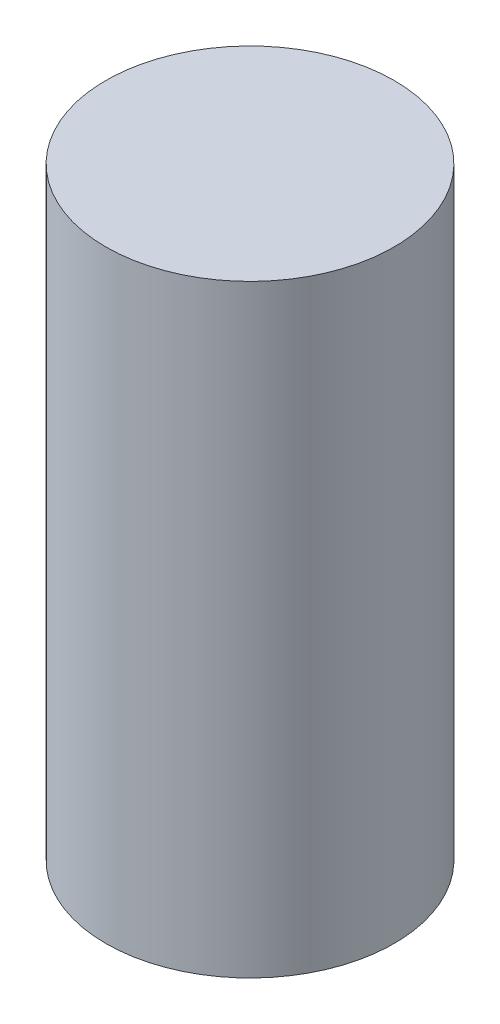
ISO-10303-21;
HEADER;
FILE_DESCRIPTION(('STEP AP214'),'2;1');
FILE_NAME('part.step','',(''),(''),'','','');
FILE_SCHEMA(('AUTOMOTIVE_DESIGN { 1 0 10303 214 1 1 1 1 }'));
ENDSEC;
DATA;
#1=APPLICATION_CONTEXT('core data for automotive mechanical design processes');
#2=APPLICATION_PROTOCOL_DEFINITION('international standard','automotive_design',2000,#1);
#3=PRODUCT_CONTEXT('',#1,'mechanical');
#4=PRODUCT('Part','Part','',(#3));
#5=PRODUCT_RELATED_PRODUCT_CATEGORY('part','',(#4));
#6=PRODUCT_DEFINITION_FORMATION('','',#4);
#7=PRODUCT_DEFINITION_CONTEXT('part definition',#1,'design');
#8=PRODUCT_DEFINITION('design','',#6,#7);
#9=PRODUCT_DEFINITION_SHAPE('','',#8);
#10=(LENGTH_UNIT() NAMED_UNIT(*) SI_UNIT(.MILLI.,.METRE.));
#11=(NAMED_UNIT(*) PLANE_ANGLE_UNIT() SI_UNIT($,.RADIAN.));
#12=(NAMED_UNIT(*) SI_UNIT($,.STERADIAN.) SOLID_ANGLE_UNIT());
#13=UNCERTAINTY_MEASURE_WITH_UNIT(LENGTH_MEASURE(1.E-05),#10,'distance_accuracy_value','');
#14=(GEOMETRIC_REPRESENTATION_CONTEXT(3) GLOBAL_UNCERTAINTY_ASSIGNED_CONTEXT((#13)) GLOBAL_UNIT_ASSIGNED_CONTEXT((#10,
#11,#12)) REPRESENTATION_CONTEXT('',''));
#15=CARTESIAN_POINT('',(0.,0.,0.));
#16=DIRECTION('',(0.,0.,1.));
#17=DIRECTION('',(1.,0.,0.));
#18=AXIS2_PLACEMENT_3D('',#15,#16,#17);
#19=CARTESIAN_POINT('',(0.,59.7803732,0.));
#20=DIRECTION('',(0.,-1.,0.));
#21=DIRECTION('',(0.,0.,-1.));
#22=AXIS2_PLACEMENT_3D('',#19,#20,#21);
#23=CYLINDRICAL_SURFACE('',#22,14.2875);
#24=CARTESIAN_POINT('',(0.,59.7803732,0.));
#25=DIRECTION('',(0.,1.,0.));
#26=DIRECTION('',(0.,0.,1.));
#27=AXIS2_PLACEMENT_3D('',#24,#25,#26);
#28=CIRCLE('',#27,14.2875);
#29=CARTESIAN_POINT('',(0.,59.7803732,14.2875));
#30=VERTEX_POINT('',#29);
#31=EDGE_CURVE('E10',#30,#30,#28,.T.);
#32=ORIENTED_EDGE('',*,*,#31,.F.);
#33=EDGE_LOOP('',(#32));
#34=FACE_BOUND('',#33,.T.);
#35=CARTESIAN_POINT('',(0.,0.,0.));
#36=DIRECTION('',(0.,1.,0.));
#37=DIRECTION('',(0.,0.,1.));
#38=AXIS2_PLACEMENT_3D('',#35,#36,#37);
#39=CIRCLE('',#38,14.2875);
#40=CARTESIAN_POINT('',(0.,0.,14.2875));
#41=VERTEX_POINT('',#40);
#42=EDGE_CURVE('E42',#41,#41,#39,.T.);
#43=ORIENTED_EDGE('',*,*,#42,.T.);
#44=EDGE_LOOP('',(#43));
#45=FACE_BOUND('',#44,.T.);
#46=ADVANCED_FACE('F39',(#34,#45),#23,.T.);
#47=CARTESIAN_POINT('',(0.,59.7803732,0.));
#48=DIRECTION('',(0.,1.,0.));
#49=DIRECTION('',(0.,0.,1.));
#50=AXIS2_PLACEMENT_3D('',#47,#48,#49);
#51=PLANE('',#50);
#52=ORIENTED_EDGE('',*,*,#31,.T.);
#53=EDGE_LOOP('',(#52));
#54=FACE_BOUND('',#53,.T.);
#55=ADVANCED_FACE('F56',(#54),#51,.T.);
#56=CARTESIAN_POINT('',(0.,0.,0.));
#57=DIRECTION('',(0.,1.,0.));
#58=DIRECTION('',(0.,0.,1.));
#59=AXIS2_PLACEMENT_3D('',#56,#57,#58);
#60=PLANE('',#59);
#61=ORIENTED_EDGE('',*,*,#42,.F.);
#62=EDGE_LOOP('',(#61));
#63=FACE_BOUND('',#62,.T.);
#64=ADVANCED_FACE('F54',(#63),#60,.F.);
#65=CLOSED_SHELL('',(#46,#55,#64));
#66=MANIFOLD_SOLID_BREP('B2',#65);
#67=ADVANCED_BREP_SHAPE_REPRESENTATION('',(#18,#66),#14);
#68=SHAPE_DEFINITION_REPRESENTATION(#9,#67);
ENDSEC;
END-ISO-10303-21;
